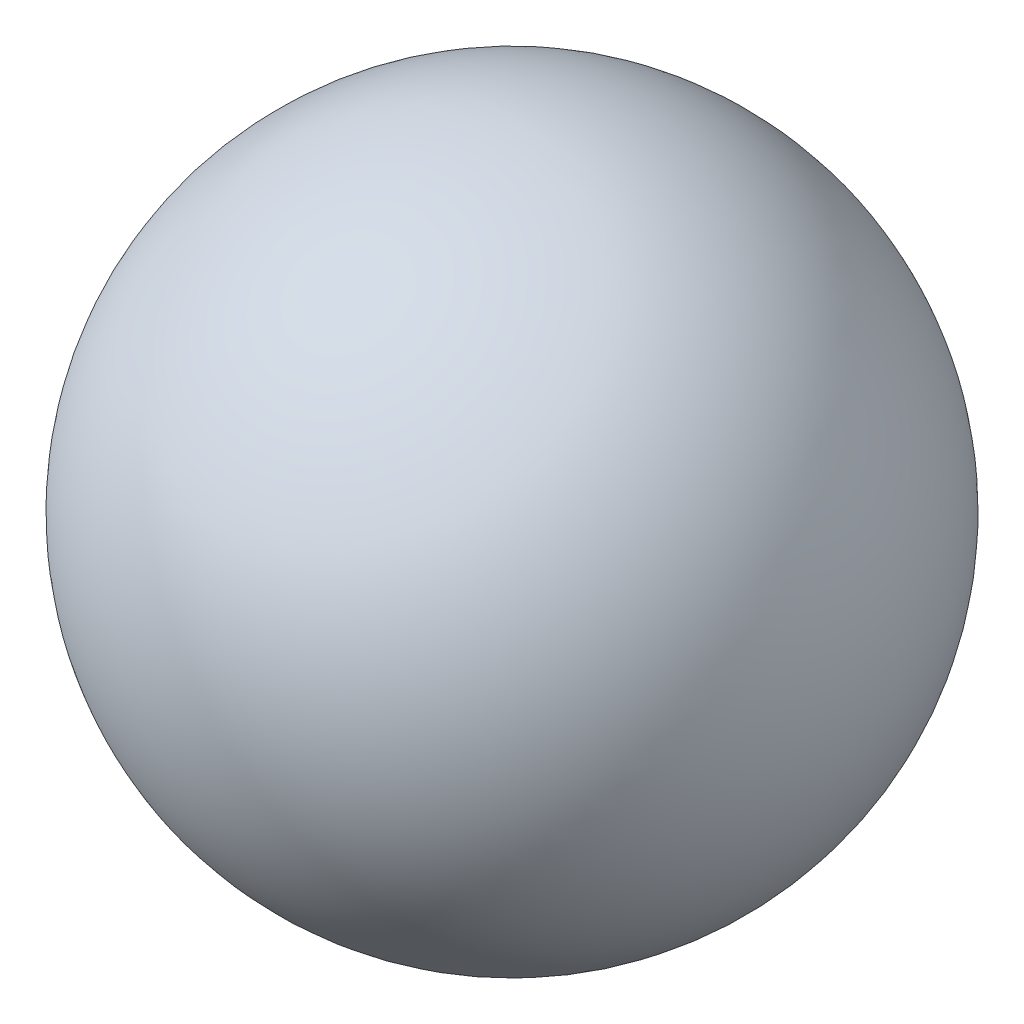
ISO-10303-21;
HEADER;
FILE_DESCRIPTION(('STEP AP214'),'2;1');
FILE_NAME('part.step','',(''),(''),'','','');
FILE_SCHEMA(('AUTOMOTIVE_DESIGN { 1 0 10303 214 1 1 1 1 }'));
ENDSEC;
DATA;
#1=APPLICATION_CONTEXT('core data for automotive mechanical design processes');
#2=APPLICATION_PROTOCOL_DEFINITION('international standard','automotive_design',2000,#1);
#3=PRODUCT_CONTEXT('',#1,'mechanical');
#4=PRODUCT('Part','Part','',(#3));
#5=PRODUCT_RELATED_PRODUCT_CATEGORY('part','',(#4));
#6=PRODUCT_DEFINITION_FORMATION('','',#4);
#7=PRODUCT_DEFINITION_CONTEXT('part definition',#1,'design');
#8=PRODUCT_DEFINITION('design','',#6,#7);
#9=PRODUCT_DEFINITION_SHAPE('','',#8);
#10=(LENGTH_UNIT() NAMED_UNIT(*) SI_UNIT(.MILLI.,.METRE.));
#11=(NAMED_UNIT(*) PLANE_ANGLE_UNIT() SI_UNIT($,.RADIAN.));
#12=(NAMED_UNIT(*) SI_UNIT($,.STERADIAN.) SOLID_ANGLE_UNIT());
#13=UNCERTAINTY_MEASURE_WITH_UNIT(LENGTH_MEASURE(1.E-05),#10,'distance_accuracy_value','');
#14=(GEOMETRIC_REPRESENTATION_CONTEXT(3) GLOBAL_UNCERTAINTY_ASSIGNED_CONTEXT((#13)) GLOBAL_UNIT_ASSIGNED_CONTEXT((#10,
#11,#12)) REPRESENTATION_CONTEXT('',''));
#15=CARTESIAN_POINT('',(0.,0.,0.));
#16=DIRECTION('',(0.,0.,1.));
#17=DIRECTION('',(1.,0.,0.));
#18=AXIS2_PLACEMENT_3D('',#15,#16,#17);
#19=CARTESIAN_POINT('',(8.88005749866254,-2.,-7.69461362385709));
#20=DIRECTION('',(0.,0.,1.));
#21=DIRECTION('',(1.,0.,0.));
#22=AXIS2_PLACEMENT_3D('',#19,#20,#21);
#23=SPHERICAL_SURFACE('',#22,1.05);
#24=CARTESIAN_POINT('',(8.88005749866254,-2.,-6.64461362385709));
#25=VERTEX_POINT('',#24);
#26=VERTEX_LOOP('',#25);
#27=FACE_BOUND('',#26,.T.);
#28=ADVANCED_FACE('F12',(#27),#23,.T.);
#29=CLOSED_SHELL('',(#28));
#30=MANIFOLD_SOLID_BREP('B1',#29);
#31=ADVANCED_BREP_SHAPE_REPRESENTATION('',(#18,#30),#14);
#32=SHAPE_DEFINITION_REPRESENTATION(#9,#31);
ENDSEC;
END-ISO-10303-21;
